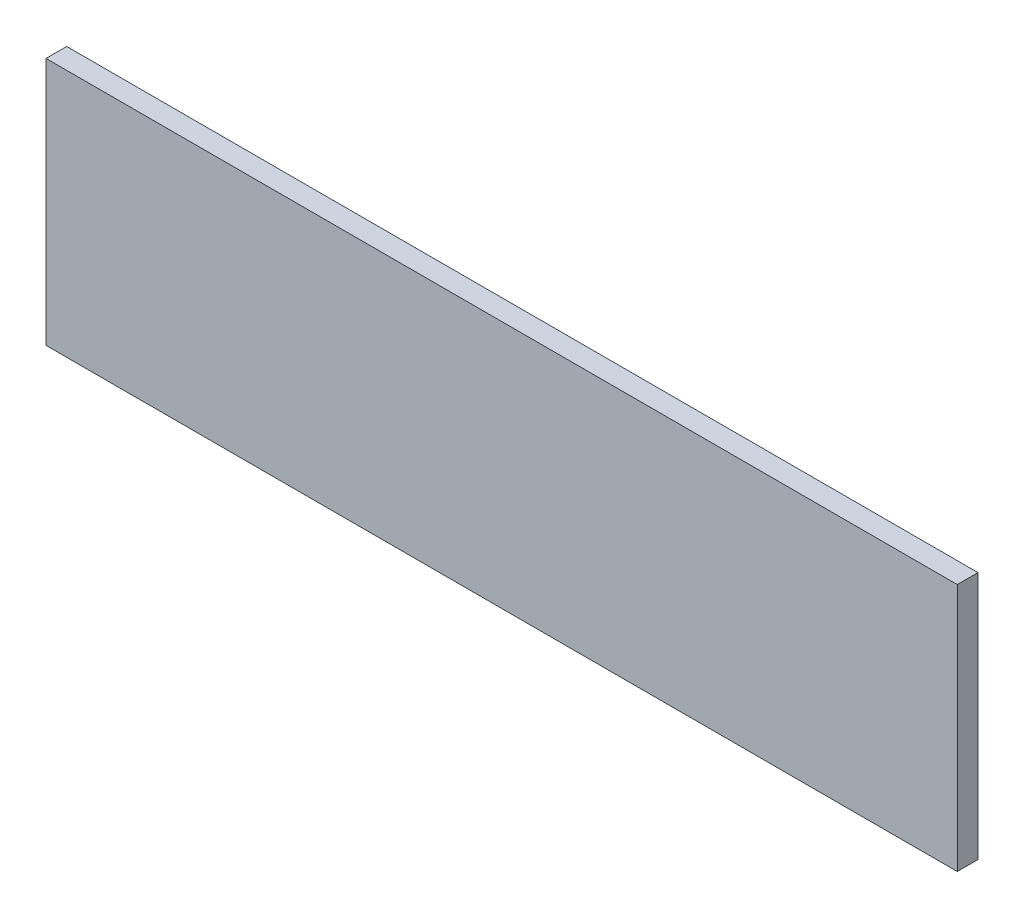
ISO-10303-21;
HEADER;
FILE_DESCRIPTION(('STEP AP214'),'2;1');
FILE_NAME('part.step','',(''),(''),'','','');
FILE_SCHEMA(('AUTOMOTIVE_DESIGN { 1 0 10303 214 1 1 1 1 }'));
ENDSEC;
DATA;
#1=APPLICATION_CONTEXT('core data for automotive mechanical design processes');
#2=APPLICATION_PROTOCOL_DEFINITION('international standard','automotive_design',2000,#1);
#3=PRODUCT_CONTEXT('',#1,'mechanical');
#4=PRODUCT('Part','Part','',(#3));
#5=PRODUCT_RELATED_PRODUCT_CATEGORY('part','',(#4));
#6=PRODUCT_DEFINITION_FORMATION('','',#4);
#7=PRODUCT_DEFINITION_CONTEXT('part definition',#1,'design');
#8=PRODUCT_DEFINITION('design','',#6,#7);
#9=PRODUCT_DEFINITION_SHAPE('','',#8);
#10=(LENGTH_UNIT() NAMED_UNIT(*) SI_UNIT(.MILLI.,.METRE.));
#11=(NAMED_UNIT(*) PLANE_ANGLE_UNIT() SI_UNIT($,.RADIAN.));
#12=(NAMED_UNIT(*) SI_UNIT($,.STERADIAN.) SOLID_ANGLE_UNIT());
#13=UNCERTAINTY_MEASURE_WITH_UNIT(LENGTH_MEASURE(1.E-05),#10,'distance_accuracy_value','');
#14=(GEOMETRIC_REPRESENTATION_CONTEXT(3) GLOBAL_UNCERTAINTY_ASSIGNED_CONTEXT((#13)) GLOBAL_UNIT_ASSIGNED_CONTEXT((#10,
#11,#12)) REPRESENTATION_CONTEXT('',''));
#15=CARTESIAN_POINT('',(0.,0.,0.));
#16=DIRECTION('',(0.,0.,1.));
#17=DIRECTION('',(1.,0.,0.));
#18=AXIS2_PLACEMENT_3D('',#15,#16,#17);
#19=CARTESIAN_POINT('',(0.,0.,6.35));
#20=DIRECTION('',(1.,0.,0.));
#21=DIRECTION('',(0.,0.,-1.));
#22=AXIS2_PLACEMENT_3D('',#19,#20,#21);
#23=PLANE('',#22);
#24=DIRECTION('',(0.,-1.,0.));
#25=VECTOR('',#24,1.);
#26=CARTESIAN_POINT('',(0.,0.,0.));
#27=LINE('',#26,#25);
#28=CARTESIAN_POINT('',(0.,76.2,0.));
#29=VERTEX_POINT('',#28);
#30=CARTESIAN_POINT('',(0.,0.,0.));
#31=VERTEX_POINT('',#30);
#32=EDGE_CURVE('E107',#29,#31,#27,.T.);
#33=ORIENTED_EDGE('',*,*,#32,.T.);
#34=DIRECTION('',(0.,0.,-1.));
#35=VECTOR('',#34,1.);
#36=CARTESIAN_POINT('',(0.,0.,6.35));
#37=LINE('',#36,#35);
#38=CARTESIAN_POINT('',(0.,0.,6.35));
#39=VERTEX_POINT('',#38);
#40=EDGE_CURVE('E11',#39,#31,#37,.T.);
#41=ORIENTED_EDGE('',*,*,#40,.F.);
#42=DIRECTION('',(0.,-1.,0.));
#43=VECTOR('',#42,1.);
#44=CARTESIAN_POINT('',(0.,0.,6.35));
#45=LINE('',#44,#43);
#46=CARTESIAN_POINT('',(0.,76.2,6.35));
#47=VERTEX_POINT('',#46);
#48=EDGE_CURVE('E91',#47,#39,#45,.T.);
#49=ORIENTED_EDGE('',*,*,#48,.F.);
#50=DIRECTION('',(0.,0.,-1.));
#51=VECTOR('',#50,1.);
#52=CARTESIAN_POINT('',(0.,76.2,6.35));
#53=LINE('',#52,#51);
#54=EDGE_CURVE('E103',#47,#29,#53,.T.);
#55=ORIENTED_EDGE('',*,*,#54,.T.);
#56=EDGE_LOOP('',(#33,#41,#49,#55));
#57=FACE_BOUND('',#56,.T.);
#58=ADVANCED_FACE('F39',(#57),#23,.F.);
#59=CARTESIAN_POINT('',(0.,0.,6.35));
#60=DIRECTION('',(0.,1.,0.));
#61=DIRECTION('',(0.,0.,1.));
#62=AXIS2_PLACEMENT_3D('',#59,#60,#61);
#63=PLANE('',#62);
#64=DIRECTION('',(1.,0.,0.));
#65=VECTOR('',#64,1.);
#66=CARTESIAN_POINT('',(0.,0.,0.));
#67=LINE('',#66,#65);
#68=CARTESIAN_POINT('',(279.4,0.,0.));
#69=VERTEX_POINT('',#68);
#70=EDGE_CURVE('E96',#31,#69,#67,.T.);
#71=ORIENTED_EDGE('',*,*,#70,.T.);
#72=DIRECTION('',(0.,0.,-1.));
#73=VECTOR('',#72,1.);
#74=CARTESIAN_POINT('',(279.4,0.,6.35));
#75=LINE('',#74,#73);
#76=CARTESIAN_POINT('',(279.4,0.,6.35));
#77=VERTEX_POINT('',#76);
#78=EDGE_CURVE('E48',#77,#69,#75,.T.);
#79=ORIENTED_EDGE('',*,*,#78,.F.);
#80=DIRECTION('',(1.,0.,0.));
#81=VECTOR('',#80,1.);
#82=CARTESIAN_POINT('',(0.,0.,6.35));
#83=LINE('',#82,#81);
#84=EDGE_CURVE('E86',#39,#77,#83,.T.);
#85=ORIENTED_EDGE('',*,*,#84,.F.);
#86=ORIENTED_EDGE('',*,*,#40,.T.);
#87=EDGE_LOOP('',(#71,#79,#85,#86));
#88=FACE_BOUND('',#87,.T.);
#89=ADVANCED_FACE('F95',(#88),#63,.F.);
#90=CARTESIAN_POINT('',(279.4,0.,6.35));
#91=DIRECTION('',(-1.,0.,0.));
#92=DIRECTION('',(0.,0.,1.));
#93=AXIS2_PLACEMENT_3D('',#90,#91,#92);
#94=PLANE('',#93);
#95=DIRECTION('',(0.,1.,0.));
#96=VECTOR('',#95,1.);
#97=CARTESIAN_POINT('',(279.4,0.,0.));
#98=LINE('',#97,#96);
#99=CARTESIAN_POINT('',(279.4,76.2,0.));
#100=VERTEX_POINT('',#99);
#101=EDGE_CURVE('E73',#69,#100,#98,.T.);
#102=ORIENTED_EDGE('',*,*,#101,.T.);
#103=DIRECTION('',(0.,0.,-1.));
#104=VECTOR('',#103,1.);
#105=CARTESIAN_POINT('',(279.4,76.2,6.35));
#106=LINE('',#105,#104);
#107=CARTESIAN_POINT('',(279.4,76.2,6.35));
#108=VERTEX_POINT('',#107);
#109=EDGE_CURVE('E98',#108,#100,#106,.T.);
#110=ORIENTED_EDGE('',*,*,#109,.F.);
#111=DIRECTION('',(0.,1.,0.));
#112=VECTOR('',#111,1.);
#113=CARTESIAN_POINT('',(279.4,0.,6.35));
#114=LINE('',#113,#112);
#115=EDGE_CURVE('E89',#77,#108,#114,.T.);
#116=ORIENTED_EDGE('',*,*,#115,.F.);
#117=ORIENTED_EDGE('',*,*,#78,.T.);
#118=EDGE_LOOP('',(#102,#110,#116,#117));
#119=FACE_BOUND('',#118,.T.);
#120=ADVANCED_FACE('F99',(#119),#94,.F.);
#121=CARTESIAN_POINT('',(0.,76.2,6.35));
#122=DIRECTION('',(0.,-1.,0.));
#123=DIRECTION('',(0.,0.,-1.));
#124=AXIS2_PLACEMENT_3D('',#121,#122,#123);
#125=PLANE('',#124);
#126=DIRECTION('',(-1.,0.,0.));
#127=VECTOR('',#126,1.);
#128=CARTESIAN_POINT('',(0.,76.2,0.));
#129=LINE('',#128,#127);
#130=EDGE_CURVE('E79',#100,#29,#129,.T.);
#131=ORIENTED_EDGE('',*,*,#130,.T.);
#132=ORIENTED_EDGE('',*,*,#54,.F.);
#133=DIRECTION('',(-1.,0.,0.));
#134=VECTOR('',#133,1.);
#135=CARTESIAN_POINT('',(0.,76.2,6.35));
#136=LINE('',#135,#134);
#137=EDGE_CURVE('E56',#108,#47,#136,.T.);
#138=ORIENTED_EDGE('',*,*,#137,.F.);
#139=ORIENTED_EDGE('',*,*,#109,.T.);
#140=EDGE_LOOP('',(#131,#132,#138,#139));
#141=FACE_BOUND('',#140,.T.);
#142=ADVANCED_FACE('F120',(#141),#125,.F.);
#143=CARTESIAN_POINT('',(0.,0.,6.35));
#144=DIRECTION('',(0.,0.,-1.));
#145=DIRECTION('',(-1.,0.,0.));
#146=AXIS2_PLACEMENT_3D('',#143,#144,#145);
#147=PLANE('',#146);
#148=ORIENTED_EDGE('',*,*,#48,.T.);
#149=ORIENTED_EDGE('',*,*,#84,.T.);
#150=ORIENTED_EDGE('',*,*,#115,.T.);
#151=ORIENTED_EDGE('',*,*,#137,.T.);
#152=EDGE_LOOP('',(#148,#149,#150,#151));
#153=FACE_BOUND('',#152,.T.);
#154=ADVANCED_FACE('F87',(#153),#147,.F.);
#155=CARTESIAN_POINT('',(0.,0.,0.));
#156=DIRECTION('',(0.,0.,-1.));
#157=DIRECTION('',(-1.,0.,0.));
#158=AXIS2_PLACEMENT_3D('',#155,#156,#157);
#159=PLANE('',#158);
#160=ORIENTED_EDGE('',*,*,#32,.F.);
#161=ORIENTED_EDGE('',*,*,#130,.F.);
#162=ORIENTED_EDGE('',*,*,#101,.F.);
#163=ORIENTED_EDGE('',*,*,#70,.F.);
#164=EDGE_LOOP('',(#160,#161,#162,#163));
#165=FACE_BOUND('',#164,.T.);
#166=ADVANCED_FACE('F123',(#165),#159,.T.);
#167=CLOSED_SHELL('',(#58,#89,#120,#142,#154,#166));
#168=MANIFOLD_SOLID_BREP('B2',#167);
#169=ADVANCED_BREP_SHAPE_REPRESENTATION('',(#18,#168),#14);
#170=SHAPE_DEFINITION_REPRESENTATION(#9,#169);
ENDSEC;
END-ISO-10303-21;
